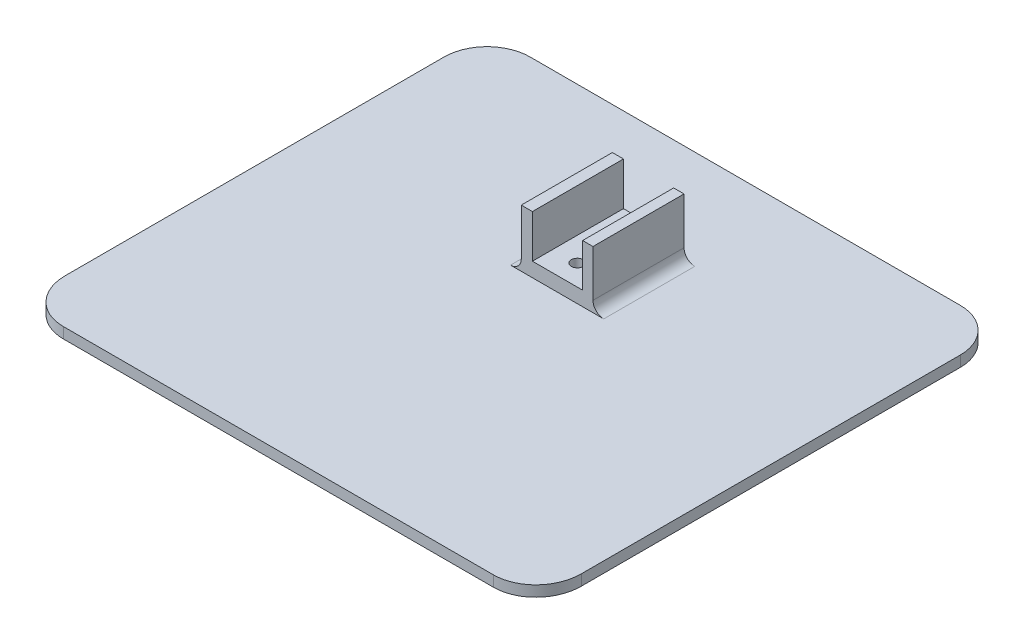
ISO-10303-21;
HEADER;
FILE_DESCRIPTION(('STEP AP214'),'2;1');
FILE_NAME('part.step','',(''),(''),'','','');
FILE_SCHEMA(('AUTOMOTIVE_DESIGN { 1 0 10303 214 1 1 1 1 }'));
ENDSEC;
DATA;
#1=APPLICATION_CONTEXT('core data for automotive mechanical design processes');
#2=APPLICATION_PROTOCOL_DEFINITION('international standard','automotive_design',2000,#1);
#3=PRODUCT_CONTEXT('',#1,'mechanical');
#4=PRODUCT('Part','Part','',(#3));
#5=PRODUCT_RELATED_PRODUCT_CATEGORY('part','',(#4));
#6=PRODUCT_DEFINITION_FORMATION('','',#4);
#7=PRODUCT_DEFINITION_CONTEXT('part definition',#1,'design');
#8=PRODUCT_DEFINITION('design','',#6,#7);
#9=PRODUCT_DEFINITION_SHAPE('','',#8);
#10=(LENGTH_UNIT() NAMED_UNIT(*) SI_UNIT(.MILLI.,.METRE.));
#11=(NAMED_UNIT(*) PLANE_ANGLE_UNIT() SI_UNIT($,.RADIAN.));
#12=(NAMED_UNIT(*) SI_UNIT($,.STERADIAN.) SOLID_ANGLE_UNIT());
#13=UNCERTAINTY_MEASURE_WITH_UNIT(LENGTH_MEASURE(1.E-05),#10,'distance_accuracy_value','');
#14=(GEOMETRIC_REPRESENTATION_CONTEXT(3) GLOBAL_UNCERTAINTY_ASSIGNED_CONTEXT((#13)) GLOBAL_UNIT_ASSIGNED_CONTEXT((#10,
#11,#12)) REPRESENTATION_CONTEXT('',''));
#15=CARTESIAN_POINT('',(0.,0.,0.));
#16=DIRECTION('',(0.,0.,1.));
#17=DIRECTION('',(1.,0.,0.));
#18=AXIS2_PLACEMENT_3D('',#15,#16,#17);
#19=CARTESIAN_POINT('',(-0.0197137799095512,3.,-9.76257394077398));
#20=DIRECTION('',(0.,-1.,0.));
#21=DIRECTION('',(0.,0.,-1.));
#22=AXIS2_PLACEMENT_3D('',#19,#20,#21);
#23=CYLINDRICAL_SURFACE('',#22,1.65586460411408);
#24=CARTESIAN_POINT('',(-0.0197137799095512,7.,-9.76257394077398));
#25=DIRECTION('',(0.,-1.,0.));
#26=DIRECTION('',(0.,0.,-1.));
#27=AXIS2_PLACEMENT_3D('',#24,#25,#26);
#28=CIRCLE('',#27,1.65586460411408);
#29=CARTESIAN_POINT('',(-0.0197137799095512,7.,-11.4184385448881));
#30=VERTEX_POINT('',#29);
#31=EDGE_CURVE('E336',#30,#30,#28,.T.);
#32=ORIENTED_EDGE('',*,*,#31,.F.);
#33=EDGE_LOOP('',(#32));
#34=FACE_BOUND('',#33,.T.);
#35=CARTESIAN_POINT('',(-0.0197137799095512,3.,-9.76257394077398));
#36=DIRECTION('',(0.,-1.,0.));
#37=DIRECTION('',(0.,0.,-1.));
#38=AXIS2_PLACEMENT_3D('',#35,#36,#37);
#39=CIRCLE('',#38,1.65586460411408);
#40=CARTESIAN_POINT('',(-0.0197137799095512,3.,-11.4184385448881));
#41=VERTEX_POINT('',#40);
#42=EDGE_CURVE('E45',#41,#41,#39,.T.);
#43=ORIENTED_EDGE('',*,*,#42,.T.);
#44=EDGE_LOOP('',(#43));
#45=FACE_BOUND('',#44,.T.);
#46=ADVANCED_FACE('F41',(#34,#45),#23,.F.);
#47=CARTESIAN_POINT('',(0.208651947899256,3.,-24.3779805205377));
#48=DIRECTION('',(0.,-1.,0.));
#49=DIRECTION('',(0.,0.,-1.));
#50=AXIS2_PLACEMENT_3D('',#47,#48,#49);
#51=CYLINDRICAL_SURFACE('',#50,1.65586460411408);
#52=CARTESIAN_POINT('',(0.208651947899256,7.,-24.3779805205377));
#53=DIRECTION('',(0.,-1.,0.));
#54=DIRECTION('',(0.,0.,-1.));
#55=AXIS2_PLACEMENT_3D('',#52,#53,#54);
#56=CIRCLE('',#55,1.65586460411408);
#57=CARTESIAN_POINT('',(0.208651947899256,7.,-26.0338451246518));
#58=VERTEX_POINT('',#57);
#59=EDGE_CURVE('E332',#58,#58,#56,.T.);
#60=ORIENTED_EDGE('',*,*,#59,.F.);
#61=EDGE_LOOP('',(#60));
#62=FACE_BOUND('',#61,.T.);
#63=CARTESIAN_POINT('',(0.208651947899256,3.,-24.3779805205377));
#64=DIRECTION('',(0.,-1.,0.));
#65=DIRECTION('',(0.,0.,-1.));
#66=AXIS2_PLACEMENT_3D('',#63,#64,#65);
#67=CIRCLE('',#66,1.65586460411408);
#68=CARTESIAN_POINT('',(0.208651947899256,3.,-26.0338451246518));
#69=VERTEX_POINT('',#68);
#70=EDGE_CURVE('E293',#69,#69,#67,.T.);
#71=ORIENTED_EDGE('',*,*,#70,.T.);
#72=EDGE_LOOP('',(#71));
#73=FACE_BOUND('',#72,.T.);
#74=ADVANCED_FACE('F258',(#62,#73),#51,.F.);
#75=CARTESIAN_POINT('',(0.,19.,0.));
#76=DIRECTION('',(0.,1.,0.));
#77=DIRECTION('',(0.,0.,1.));
#78=AXIS2_PLACEMENT_3D('',#75,#76,#77);
#79=PLANE('',#78);
#80=DIRECTION('',(-1.,0.,0.));
#81=VECTOR('',#80,1.);
#82=CARTESIAN_POINT('',(-9.83844917910209,19.,-29.348399165478));
#83=LINE('',#82,#81);
#84=CARTESIAN_POINT('',(10.1615508208979,19.,-29.348399165478));
#85=VERTEX_POINT('',#84);
#86=CARTESIAN_POINT('',(7.26901039257119,19.,-29.348399165478));
#87=VERTEX_POINT('',#86);
#88=EDGE_CURVE('E187',#85,#87,#83,.T.);
#89=ORIENTED_EDGE('',*,*,#88,.T.);
#90=DIRECTION('',(0.,0.,1.));
#91=VECTOR('',#90,1.);
#92=CARTESIAN_POINT('',(7.26901039257119,19.,-31.8785328430936));
#93=LINE('',#92,#91);
#94=CARTESIAN_POINT('',(7.26901039257119,19.,-3.94881677280326));
#95=VERTEX_POINT('',#94);
#96=EDGE_CURVE('E169',#87,#95,#93,.T.);
#97=ORIENTED_EDGE('',*,*,#96,.T.);
#98=DIRECTION('',(1.,0.,0.));
#99=VECTOR('',#98,1.);
#100=CARTESIAN_POINT('',(-9.83844917910209,19.,-3.94881677280326));
#101=LINE('',#100,#99);
#102=CARTESIAN_POINT('',(10.1615508208979,19.,-3.94881677280326));
#103=VERTEX_POINT('',#102);
#104=EDGE_CURVE('E347',#95,#103,#101,.T.);
#105=ORIENTED_EDGE('',*,*,#104,.T.);
#106=DIRECTION('',(0.,0.,-1.));
#107=VECTOR('',#106,1.);
#108=CARTESIAN_POINT('',(10.1615508208979,19.,-29.348399165478));
#109=LINE('',#108,#107);
#110=EDGE_CURVE('E195',#103,#85,#109,.T.);
#111=ORIENTED_EDGE('',*,*,#110,.T.);
#112=EDGE_LOOP('',(#89,#97,#105,#111));
#113=FACE_BOUND('',#112,.T.);
#114=ADVANCED_FACE('F193',(#113),#79,.T.);
#115=CARTESIAN_POINT('',(0.,3.,0.));
#116=DIRECTION('',(0.,1.,0.));
#117=DIRECTION('',(0.,0.,1.));
#118=AXIS2_PLACEMENT_3D('',#115,#116,#117);
#119=PLANE('',#118);
#120=DIRECTION('',(1.,0.,0.));
#121=VECTOR('',#120,1.);
#122=CARTESIAN_POINT('',(0.,3.,73.2589886833315));
#123=LINE('',#122,#121);
#124=CARTESIAN_POINT('',(-60.3911568152237,3.,73.2589886833315));
#125=VERTEX_POINT('',#124);
#126=CARTESIAN_POINT('',(59.6088431847762,3.,73.2589886833315));
#127=VERTEX_POINT('',#126);
#128=EDGE_CURVE('E227',#125,#127,#123,.T.);
#129=ORIENTED_EDGE('',*,*,#128,.T.);
#130=CARTESIAN_POINT('',(59.6088431847762,3.,73.2589886833315));
#131=CARTESIAN_POINT('',(60.1618256869811,3.,73.2589886833315));
#132=CARTESIAN_POINT('',(61.2791976498757,3.,73.1739631705418));
#133=CARTESIAN_POINT('',(62.8603074504887,3.,72.8306509965947));
#134=CARTESIAN_POINT('',(64.3486949624694,3.,72.2799535128836));
#135=CARTESIAN_POINT('',(66.0617717719845,3.,71.3753361875597));
#136=CARTESIAN_POINT('',(67.80435595317,3.,70.0062381590203));
#137=CARTESIAN_POINT('',(69.8226268527934,3.,67.6166682396859));
#138=CARTESIAN_POINT('',(71.258952654355,3.,64.4790605567734));
#139=CARTESIAN_POINT('',(71.6088431847769,3.,61.9992828553231));
#140=CARTESIAN_POINT('',(71.6088431847769,3.,60.7355746909624));
#141=B_SPLINE_CURVE_WITH_KNOTS('',3,(#130,#131,#132,#133,#134,#135,#136,#137,#138,#139,#140),
.UNSPECIFIED.,.F.,.F.,(4,1,1,1,1,1,1,1,4),(0.,0.0625,0.125,0.1875,0.25,0.375,0.5,0.75,1.),.UNSPECIFIED.);
#142=CARTESIAN_POINT('',(71.6088431847769,3.,60.7355746909624));
#143=VERTEX_POINT('',#142);
#144=EDGE_CURVE('E231',#127,#143,#141,.T.);
#145=ORIENTED_EDGE('',*,*,#144,.T.);
#146=DIRECTION('',(0.,0.,-1.));
#147=VECTOR('',#146,1.);
#148=CARTESIAN_POINT('',(71.6088431847769,3.,0.));
#149=LINE('',#148,#147);
#150=CARTESIAN_POINT('',(71.6088431847769,3.,-44.9655343216662));
#151=VERTEX_POINT('',#150);
#152=EDGE_CURVE('E238',#143,#151,#149,.T.);
#153=ORIENTED_EDGE('',*,*,#152,.T.);
#154=CARTESIAN_POINT('',(59.6088431847769,3.,-44.9655343216662));
#155=DIRECTION('',(0.,1.,0.));
#156=DIRECTION('',(0.,0.,1.));
#157=AXIS2_PLACEMENT_3D('',#154,#155,#156);
#158=CIRCLE('',#157,12.);
#159=CARTESIAN_POINT('',(59.6088431847769,3.,-56.9655343216662));
#160=VERTEX_POINT('',#159);
#161=EDGE_CURVE('E501',#151,#160,#158,.T.);
#162=ORIENTED_EDGE('',*,*,#161,.T.);
#163=DIRECTION('',(-1.,0.,0.));
#164=VECTOR('',#163,1.);
#165=CARTESIAN_POINT('',(0.,3.,-56.9655343216662));
#166=LINE('',#165,#164);
#167=CARTESIAN_POINT('',(-60.3911568152231,3.,-56.9655343216662));
#168=VERTEX_POINT('',#167);
#169=EDGE_CURVE('E486',#160,#168,#166,.T.);
#170=ORIENTED_EDGE('',*,*,#169,.T.);
#171=CARTESIAN_POINT('',(-60.3911568152231,3.,-44.9655343216662));
#172=DIRECTION('',(0.,1.,0.));
#173=DIRECTION('',(0.,0.,1.));
#174=AXIS2_PLACEMENT_3D('',#171,#172,#173);
#175=CIRCLE('',#174,12.);
#176=CARTESIAN_POINT('',(-72.3911568152231,3.,-44.9655343216662));
#177=VERTEX_POINT('',#176);
#178=EDGE_CURVE('E498',#168,#177,#175,.T.);
#179=ORIENTED_EDGE('',*,*,#178,.T.);
#180=DIRECTION('',(0.,0.,1.));
#181=VECTOR('',#180,1.);
#182=CARTESIAN_POINT('',(-72.3911568152231,3.,0.));
#183=LINE('',#182,#181);
#184=CARTESIAN_POINT('',(-72.3911568152231,3.,60.735574690963));
#185=VERTEX_POINT('',#184);
#186=EDGE_CURVE('E446',#177,#185,#183,.T.);
#187=ORIENTED_EDGE('',*,*,#186,.T.);
#188=CARTESIAN_POINT('',(-72.3911568152231,3.,60.735574690963));
#189=CARTESIAN_POINT('',(-72.3911568152231,3.,61.9921082250135));
#190=CARTESIAN_POINT('',(-72.1317676515068,3.,63.8412639961743));
#191=CARTESIAN_POINT('',(-71.1931340745274,3.,66.3312469236623));
#192=CARTESIAN_POINT('',(-70.1157544615747,3.,68.1934553387815));
#193=CARTESIAN_POINT('',(-68.6029168241761,3.,69.9901557441223));
#194=CARTESIAN_POINT('',(-66.8710431968823,3.,71.3562374650594));
#195=CARTESIAN_POINT('',(-65.1677731110002,3.,72.2641275582115));
#196=CARTESIAN_POINT('',(-63.6719548826544,3.,72.8224699197793));
#197=CARTESIAN_POINT('',(-62.0831439762588,3.,73.1709829742362));
#198=CARTESIAN_POINT('',(-60.9505699439983,3.,73.2589886833314));
#199=CARTESIAN_POINT('',(-60.3911568152237,3.,73.2589886833315));
#200=B_SPLINE_CURVE_WITH_KNOTS('',3,(#188,#189,#190,#191,#192,#193,#194,#195,#196,#197,#198,
#199),.UNSPECIFIED.,.F.,.F.,(4,1,1,1,1,1,1,1,1,4),(0.,0.25,0.375,0.5,0.625,0.75,0.8125,0.875,
0.9375,1.),.UNSPECIFIED.);
#201=EDGE_CURVE('E407',#185,#125,#200,.T.);
#202=ORIENTED_EDGE('',*,*,#201,.T.);
#203=EDGE_LOOP('',(#129,#145,#153,#162,#170,#179,#187,#202));
#204=FACE_BOUND('',#203,.T.);
#205=DIRECTION('',(-1.,0.,0.));
#206=VECTOR('',#205,1.);
#207=CARTESIAN_POINT('',(-9.83844917910209,3.,-29.348399165478));
#208=LINE('',#207,#206);
#209=CARTESIAN_POINT('',(13.1615508208979,3.,-29.348399165478));
#210=VERTEX_POINT('',#209);
#211=CARTESIAN_POINT('',(-12.8384491791021,3.,-29.348399165478));
#212=VERTEX_POINT('',#211);
#213=EDGE_CURVE('E211',#210,#212,#208,.T.);
#214=ORIENTED_EDGE('',*,*,#213,.F.);
#215=DIRECTION('',(0.,0.,-1.));
#216=VECTOR('',#215,1.);
#217=CARTESIAN_POINT('',(13.1615508208979,3.,0.));
#218=LINE('',#217,#216);
#219=CARTESIAN_POINT('',(13.1615508208979,3.,-3.94881677280326));
#220=VERTEX_POINT('',#219);
#221=EDGE_CURVE('E278',#210,#220,#218,.F.);
#222=ORIENTED_EDGE('',*,*,#221,.T.);
#223=DIRECTION('',(1.,0.,0.));
#224=VECTOR('',#223,1.);
#225=CARTESIAN_POINT('',(-9.83844917910209,3.,-3.94881677280326));
#226=LINE('',#225,#224);
#227=CARTESIAN_POINT('',(-12.8384491791021,3.,-3.94881677280326));
#228=VERTEX_POINT('',#227);
#229=EDGE_CURVE('E208',#228,#220,#226,.T.);
#230=ORIENTED_EDGE('',*,*,#229,.F.);
#231=DIRECTION('',(0.,0.,1.));
#232=VECTOR('',#231,1.);
#233=CARTESIAN_POINT('',(-12.8384491791021,3.,0.));
#234=LINE('',#233,#232);
#235=EDGE_CURVE('E360',#228,#212,#234,.F.);
#236=ORIENTED_EDGE('',*,*,#235,.T.);
#237=EDGE_LOOP('',(#214,#222,#230,#236));
#238=FACE_BOUND('',#237,.T.);
#239=ADVANCED_FACE('F254',(#204,#238),#119,.T.);
#240=CARTESIAN_POINT('',(0.,3.,73.2589886833315));
#241=DIRECTION('',(0.,0.,-1.));
#242=DIRECTION('',(-1.,0.,0.));
#243=AXIS2_PLACEMENT_3D('',#240,#241,#242);
#244=PLANE('',#243);
#245=DIRECTION('',(1.,0.,0.));
#246=VECTOR('',#245,1.);
#247=CARTESIAN_POINT('',(0.,0.,73.2589886833315));
#248=LINE('',#247,#246);
#249=CARTESIAN_POINT('',(-60.3911568152237,0.,73.2589886833315));
#250=VERTEX_POINT('',#249);
#251=CARTESIAN_POINT('',(59.6088431847762,0.,73.2589886833315));
#252=VERTEX_POINT('',#251);
#253=EDGE_CURVE('E226',#250,#252,#248,.T.);
#254=ORIENTED_EDGE('',*,*,#253,.T.);
#255=DIRECTION('',(0.,-1.,0.));
#256=VECTOR('',#255,1.);
#257=CARTESIAN_POINT('',(59.6088431847762,3.,73.2589886833315));
#258=LINE('',#257,#256);
#259=EDGE_CURVE('E375',#127,#252,#258,.T.);
#260=ORIENTED_EDGE('',*,*,#259,.F.);
#261=ORIENTED_EDGE('',*,*,#128,.F.);
#262=DIRECTION('',(0.,-1.,0.));
#263=VECTOR('',#262,1.);
#264=CARTESIAN_POINT('',(-60.3911568152237,3.,73.2589886833315));
#265=LINE('',#264,#263);
#266=EDGE_CURVE('E403',#125,#250,#265,.T.);
#267=ORIENTED_EDGE('',*,*,#266,.T.);
#268=EDGE_LOOP('',(#254,#260,#261,#267));
#269=FACE_BOUND('',#268,.T.);
#270=ADVANCED_FACE('F249',(#269),#244,.F.);
#271=DIRECTION('',(0.,-1.,0.));
#272=VECTOR('',#271,1.);
#273=SURFACE_OF_LINEAR_EXTRUSION('',#141,#272);
#274=CARTESIAN_POINT('',(59.6088431847762,0.,73.2589886833315));
#275=CARTESIAN_POINT('',(60.1618256869811,0.,73.2589886833315));
#276=CARTESIAN_POINT('',(61.2791976498757,0.,73.1739631705418));
#277=CARTESIAN_POINT('',(62.8603074504887,0.,72.8306509965947));
#278=CARTESIAN_POINT('',(64.3486949624694,0.,72.2799535128836));
#279=CARTESIAN_POINT('',(66.0617717719845,0.,71.3753361875597));
#280=CARTESIAN_POINT('',(67.80435595317,0.,70.0062381590203));
#281=CARTESIAN_POINT('',(69.8226268527934,0.,67.6166682396859));
#282=CARTESIAN_POINT('',(71.258952654355,0.,64.4790605567734));
#283=CARTESIAN_POINT('',(71.6088431847769,0.,61.9992828553231));
#284=CARTESIAN_POINT('',(71.6088431847769,0.,60.7355746909624));
#285=B_SPLINE_CURVE_WITH_KNOTS('',3,(#274,#275,#276,#277,#278,#279,#280,#281,#282,#283,#284),
.UNSPECIFIED.,.F.,.F.,(4,1,1,1,1,1,1,1,4),(0.,0.0625,0.125,0.1875,0.25,0.375,0.5,0.75,1.),.UNSPECIFIED.);
#286=CARTESIAN_POINT('',(71.6088431847769,0.,60.7355746909624));
#287=VERTEX_POINT('',#286);
#288=EDGE_CURVE('E430',#252,#287,#285,.T.);
#289=ORIENTED_EDGE('',*,*,#288,.T.);
#290=DIRECTION('',(0.,-1.,0.));
#291=VECTOR('',#290,1.);
#292=CARTESIAN_POINT('',(71.6088431847769,3.,60.7355746909624));
#293=LINE('',#292,#291);
#294=EDGE_CURVE('E379',#143,#287,#293,.T.);
#295=ORIENTED_EDGE('',*,*,#294,.F.);
#296=ORIENTED_EDGE('',*,*,#144,.F.);
#297=ORIENTED_EDGE('',*,*,#259,.T.);
#298=EDGE_LOOP('',(#289,#295,#296,#297));
#299=FACE_BOUND('',#298,.T.);
#300=ADVANCED_FACE('F244',(#299),#273,.F.);
#301=CARTESIAN_POINT('',(71.6088431847769,3.,0.));
#302=DIRECTION('',(-1.,0.,0.));
#303=DIRECTION('',(0.,0.,1.));
#304=AXIS2_PLACEMENT_3D('',#301,#302,#303);
#305=PLANE('',#304);
#306=DIRECTION('',(0.,0.,-1.));
#307=VECTOR('',#306,1.);
#308=CARTESIAN_POINT('',(71.6088431847769,0.,0.));
#309=LINE('',#308,#307);
#310=CARTESIAN_POINT('',(71.6088431847769,0.,-44.9655343216662));
#311=VERTEX_POINT('',#310);
#312=EDGE_CURVE('E427',#287,#311,#309,.T.);
#313=ORIENTED_EDGE('',*,*,#312,.T.);
#314=DIRECTION('',(0.,-1.,0.));
#315=VECTOR('',#314,1.);
#316=CARTESIAN_POINT('',(71.6088431847769,3.,-44.9655343216662));
#317=LINE('',#316,#315);
#318=EDGE_CURVE('E383',#151,#311,#317,.T.);
#319=ORIENTED_EDGE('',*,*,#318,.F.);
#320=ORIENTED_EDGE('',*,*,#152,.F.);
#321=ORIENTED_EDGE('',*,*,#294,.T.);
#322=EDGE_LOOP('',(#313,#319,#320,#321));
#323=FACE_BOUND('',#322,.T.);
#324=ADVANCED_FACE('F248',(#323),#305,.F.);
#325=CARTESIAN_POINT('',(59.6088431847769,3.,-44.9655343216662));
#326=DIRECTION('',(0.,-1.,0.));
#327=DIRECTION('',(0.,0.,-1.));
#328=AXIS2_PLACEMENT_3D('',#325,#326,#327);
#329=CYLINDRICAL_SURFACE('',#328,12.);
#330=CARTESIAN_POINT('',(59.6088431847769,0.,-44.9655343216662));
#331=DIRECTION('',(0.,1.,0.));
#332=DIRECTION('',(0.,0.,1.));
#333=AXIS2_PLACEMENT_3D('',#330,#331,#332);
#334=CIRCLE('',#333,12.);
#335=CARTESIAN_POINT('',(59.6088431847769,0.,-56.9655343216662));
#336=VERTEX_POINT('',#335);
#337=EDGE_CURVE('E424',#311,#336,#334,.T.);
#338=ORIENTED_EDGE('',*,*,#337,.T.);
#339=DIRECTION('',(0.,-1.,0.));
#340=VECTOR('',#339,1.);
#341=CARTESIAN_POINT('',(59.6088431847769,3.,-56.9655343216662));
#342=LINE('',#341,#340);
#343=EDGE_CURVE('E387',#160,#336,#342,.T.);
#344=ORIENTED_EDGE('',*,*,#343,.F.);
#345=ORIENTED_EDGE('',*,*,#161,.F.);
#346=ORIENTED_EDGE('',*,*,#318,.T.);
#347=EDGE_LOOP('',(#338,#344,#345,#346));
#348=FACE_BOUND('',#347,.T.);
#349=ADVANCED_FACE('F469',(#348),#329,.T.);
#350=CARTESIAN_POINT('',(0.,3.,-56.9655343216662));
#351=DIRECTION('',(0.,0.,1.));
#352=DIRECTION('',(1.,0.,0.));
#353=AXIS2_PLACEMENT_3D('',#350,#351,#352);
#354=PLANE('',#353);
#355=DIRECTION('',(-1.,0.,0.));
#356=VECTOR('',#355,1.);
#357=CARTESIAN_POINT('',(0.,0.,-56.9655343216662));
#358=LINE('',#357,#356);
#359=CARTESIAN_POINT('',(-60.3911568152231,0.,-56.9655343216662));
#360=VERTEX_POINT('',#359);
#361=EDGE_CURVE('E421',#336,#360,#358,.T.);
#362=ORIENTED_EDGE('',*,*,#361,.T.);
#363=DIRECTION('',(0.,-1.,0.));
#364=VECTOR('',#363,1.);
#365=CARTESIAN_POINT('',(-60.3911568152231,3.,-56.9655343216662));
#366=LINE('',#365,#364);
#367=EDGE_CURVE('E391',#168,#360,#366,.T.);
#368=ORIENTED_EDGE('',*,*,#367,.F.);
#369=ORIENTED_EDGE('',*,*,#169,.F.);
#370=ORIENTED_EDGE('',*,*,#343,.T.);
#371=EDGE_LOOP('',(#362,#368,#369,#370));
#372=FACE_BOUND('',#371,.T.);
#373=ADVANCED_FACE('F466',(#372),#354,.F.);
#374=CARTESIAN_POINT('',(-60.3911568152231,3.,-44.9655343216662));
#375=DIRECTION('',(0.,-1.,0.));
#376=DIRECTION('',(0.,0.,-1.));
#377=AXIS2_PLACEMENT_3D('',#374,#375,#376);
#378=CYLINDRICAL_SURFACE('',#377,12.);
#379=CARTESIAN_POINT('',(-60.3911568152231,0.,-44.9655343216662));
#380=DIRECTION('',(0.,1.,0.));
#381=DIRECTION('',(0.,0.,1.));
#382=AXIS2_PLACEMENT_3D('',#379,#380,#381);
#383=CIRCLE('',#382,12.);
#384=CARTESIAN_POINT('',(-72.3911568152231,0.,-44.9655343216662));
#385=VERTEX_POINT('',#384);
#386=EDGE_CURVE('E418',#360,#385,#383,.T.);
#387=ORIENTED_EDGE('',*,*,#386,.T.);
#388=DIRECTION('',(0.,-1.,0.));
#389=VECTOR('',#388,1.);
#390=CARTESIAN_POINT('',(-72.3911568152231,3.,-44.9655343216662));
#391=LINE('',#390,#389);
#392=EDGE_CURVE('E395',#177,#385,#391,.T.);
#393=ORIENTED_EDGE('',*,*,#392,.F.);
#394=ORIENTED_EDGE('',*,*,#178,.F.);
#395=ORIENTED_EDGE('',*,*,#367,.T.);
#396=EDGE_LOOP('',(#387,#393,#394,#395));
#397=FACE_BOUND('',#396,.T.);
#398=ADVANCED_FACE('F462',(#397),#378,.T.);
#399=CARTESIAN_POINT('',(-72.3911568152231,3.,0.));
#400=DIRECTION('',(1.,0.,0.));
#401=DIRECTION('',(0.,0.,-1.));
#402=AXIS2_PLACEMENT_3D('',#399,#400,#401);
#403=PLANE('',#402);
#404=DIRECTION('',(0.,0.,1.));
#405=VECTOR('',#404,1.);
#406=CARTESIAN_POINT('',(-72.3911568152231,0.,0.));
#407=LINE('',#406,#405);
#408=CARTESIAN_POINT('',(-72.3911568152231,0.,60.735574690963));
#409=VERTEX_POINT('',#408);
#410=EDGE_CURVE('E412',#385,#409,#407,.T.);
#411=ORIENTED_EDGE('',*,*,#410,.T.);
#412=DIRECTION('',(0.,-1.,0.));
#413=VECTOR('',#412,1.);
#414=CARTESIAN_POINT('',(-72.3911568152231,3.,60.735574690963));
#415=LINE('',#414,#413);
#416=EDGE_CURVE('E399',#185,#409,#415,.T.);
#417=ORIENTED_EDGE('',*,*,#416,.F.);
#418=ORIENTED_EDGE('',*,*,#186,.F.);
#419=ORIENTED_EDGE('',*,*,#392,.T.);
#420=EDGE_LOOP('',(#411,#417,#418,#419));
#421=FACE_BOUND('',#420,.T.);
#422=ADVANCED_FACE('F457',(#421),#403,.F.);
#423=DIRECTION('',(0.,-1.,0.));
#424=VECTOR('',#423,1.);
#425=SURFACE_OF_LINEAR_EXTRUSION('',#200,#424);
#426=CARTESIAN_POINT('',(-72.3911568152231,0.,60.735574690963));
#427=CARTESIAN_POINT('',(-72.3911568152231,0.,61.9921082250135));
#428=CARTESIAN_POINT('',(-72.1317676515068,0.,63.8412639961743));
#429=CARTESIAN_POINT('',(-71.1931340745274,0.,66.3312469236623));
#430=CARTESIAN_POINT('',(-70.1157544615747,0.,68.1934553387815));
#431=CARTESIAN_POINT('',(-68.6029168241761,0.,69.9901557441223));
#432=CARTESIAN_POINT('',(-66.8710431968823,0.,71.3562374650594));
#433=CARTESIAN_POINT('',(-65.1677731110002,0.,72.2641275582115));
#434=CARTESIAN_POINT('',(-63.6719548826544,0.,72.8224699197793));
#435=CARTESIAN_POINT('',(-62.0831439762588,0.,73.1709829742362));
#436=CARTESIAN_POINT('',(-60.9505699439983,0.,73.2589886833314));
#437=CARTESIAN_POINT('',(-60.3911568152237,0.,73.2589886833315));
#438=B_SPLINE_CURVE_WITH_KNOTS('',3,(#426,#427,#428,#429,#430,#431,#432,#433,#434,#435,#436,
#437),.UNSPECIFIED.,.F.,.F.,(4,1,1,1,1,1,1,1,1,4),(0.,0.25,0.375,0.5,0.625,0.75,0.8125,0.875,
0.9375,1.),.UNSPECIFIED.);
#439=EDGE_CURVE('E232',#409,#250,#438,.T.);
#440=ORIENTED_EDGE('',*,*,#439,.T.);
#441=ORIENTED_EDGE('',*,*,#266,.F.);
#442=ORIENTED_EDGE('',*,*,#201,.F.);
#443=ORIENTED_EDGE('',*,*,#416,.T.);
#444=EDGE_LOOP('',(#440,#441,#442,#443));
#445=FACE_BOUND('',#444,.T.);
#446=ADVANCED_FACE('F452',(#445),#425,.F.);
#447=CARTESIAN_POINT('',(0.,0.,0.));
#448=DIRECTION('',(0.,1.,0.));
#449=DIRECTION('',(0.,0.,1.));
#450=AXIS2_PLACEMENT_3D('',#447,#448,#449);
#451=PLANE('',#450);
#452=CARTESIAN_POINT('',(0.208651947899256,0.,-24.3779805205377));
#453=DIRECTION('',(0.,-1.,0.));
#454=DIRECTION('',(0.,0.,-1.));
#455=AXIS2_PLACEMENT_3D('',#452,#453,#454);
#456=CIRCLE('',#455,3.65586460411409);
#457=CARTESIAN_POINT('',(0.208651947899256,0.,-28.0338451246518));
#458=VERTEX_POINT('',#457);
#459=EDGE_CURVE('E303',#458,#458,#456,.T.);
#460=ORIENTED_EDGE('',*,*,#459,.F.);
#461=EDGE_LOOP('',(#460));
#462=FACE_BOUND('',#461,.T.);
#463=CARTESIAN_POINT('',(-0.0197137799095512,0.,-9.76257394077398));
#464=DIRECTION('',(0.,-1.,0.));
#465=DIRECTION('',(0.,0.,-1.));
#466=AXIS2_PLACEMENT_3D('',#463,#464,#465);
#467=CIRCLE('',#466,3.65586460411408);
#468=CARTESIAN_POINT('',(-0.0197137799095512,0.,-13.4184385448881));
#469=VERTEX_POINT('',#468);
#470=EDGE_CURVE('E315',#469,#469,#467,.T.);
#471=ORIENTED_EDGE('',*,*,#470,.F.);
#472=EDGE_LOOP('',(#471));
#473=FACE_BOUND('',#472,.T.);
#474=ORIENTED_EDGE('',*,*,#253,.F.);
#475=ORIENTED_EDGE('',*,*,#439,.F.);
#476=ORIENTED_EDGE('',*,*,#410,.F.);
#477=ORIENTED_EDGE('',*,*,#386,.F.);
#478=ORIENTED_EDGE('',*,*,#361,.F.);
#479=ORIENTED_EDGE('',*,*,#337,.F.);
#480=ORIENTED_EDGE('',*,*,#312,.F.);
#481=ORIENTED_EDGE('',*,*,#288,.F.);
#482=EDGE_LOOP('',(#474,#475,#476,#477,#478,#479,#480,#481));
#483=FACE_BOUND('',#482,.T.);
#484=ADVANCED_FACE('F456',(#462,#473,#483),#451,.F.);
#485=DIRECTION('',(0.,0.,1.));
#486=VECTOR('',#485,1.);
#487=CARTESIAN_POINT('',(-6.73098960742881,19.,-31.8785328430936));
#488=LINE('',#487,#486);
#489=CARTESIAN_POINT('',(-6.73098960742881,19.,-29.348399165478));
#490=VERTEX_POINT('',#489);
#491=CARTESIAN_POINT('',(-6.73098960742881,19.,-3.94881677280326));
#492=VERTEX_POINT('',#491);
#493=EDGE_CURVE('E181',#490,#492,#488,.T.);
#494=ORIENTED_EDGE('',*,*,#493,.F.);
#495=CARTESIAN_POINT('',(-9.83844917910209,19.,-29.348399165478));
#496=VERTEX_POINT('',#495);
#497=EDGE_CURVE('E199',#490,#496,#83,.T.);
#498=ORIENTED_EDGE('',*,*,#497,.T.);
#499=DIRECTION('',(0.,0.,1.));
#500=VECTOR('',#499,1.);
#501=CARTESIAN_POINT('',(-9.83844917910209,19.,-29.348399165478));
#502=LINE('',#501,#500);
#503=CARTESIAN_POINT('',(-9.83844917910209,19.,-3.94881677280326));
#504=VERTEX_POINT('',#503);
#505=EDGE_CURVE('E214',#496,#504,#502,.T.);
#506=ORIENTED_EDGE('',*,*,#505,.T.);
#507=EDGE_CURVE('E348',#504,#492,#101,.T.);
#508=ORIENTED_EDGE('',*,*,#507,.T.);
#509=EDGE_LOOP('',(#494,#498,#506,#508));
#510=FACE_BOUND('',#509,.T.);
#511=ADVANCED_FACE('F515',(#510),#79,.T.);
#512=CARTESIAN_POINT('',(-9.83844917910209,19.,-29.348399165478));
#513=DIRECTION('',(1.,0.,0.));
#514=DIRECTION('',(0.,0.,-1.));
#515=AXIS2_PLACEMENT_3D('',#512,#513,#514);
#516=PLANE('',#515);
#517=DIRECTION('',(0.,-1.,0.));
#518=VECTOR('',#517,1.);
#519=CARTESIAN_POINT('',(-9.83844917910209,19.,-29.348399165478));
#520=LINE('',#519,#518);
#521=CARTESIAN_POINT('',(-9.83844917910209,6.,-29.348399165478));
#522=VERTEX_POINT('',#521);
#523=EDGE_CURVE('E198',#496,#522,#520,.T.);
#524=ORIENTED_EDGE('',*,*,#523,.T.);
#525=DIRECTION('',(0.,0.,1.));
#526=VECTOR('',#525,1.);
#527=CARTESIAN_POINT('',(-9.83844917910209,6.,-29.348399165478));
#528=LINE('',#527,#526);
#529=CARTESIAN_POINT('',(-9.83844917910209,6.,-3.94881677280326));
#530=VERTEX_POINT('',#529);
#531=EDGE_CURVE('E290',#522,#530,#528,.T.);
#532=ORIENTED_EDGE('',*,*,#531,.T.);
#533=DIRECTION('',(0.,-1.,0.));
#534=VECTOR('',#533,1.);
#535=CARTESIAN_POINT('',(-9.83844917910209,19.,-3.94881677280326));
#536=LINE('',#535,#534);
#537=EDGE_CURVE('E222',#504,#530,#536,.T.);
#538=ORIENTED_EDGE('',*,*,#537,.F.);
#539=ORIENTED_EDGE('',*,*,#505,.F.);
#540=EDGE_LOOP('',(#524,#532,#538,#539));
#541=FACE_BOUND('',#540,.T.);
#542=ADVANCED_FACE('F517',(#541),#516,.F.);
#543=CARTESIAN_POINT('',(-9.83844917910209,19.,-3.94881677280326));
#544=DIRECTION('',(0.,0.,-1.));
#545=DIRECTION('',(-1.,0.,0.));
#546=AXIS2_PLACEMENT_3D('',#543,#544,#545);
#547=PLANE('',#546);
#548=DIRECTION('',(-1.,0.,0.));
#549=VECTOR('',#548,1.);
#550=CARTESIAN_POINT('',(-9.83844917910209,7.,-3.94881677280326));
#551=LINE('',#550,#549);
#552=CARTESIAN_POINT('',(7.26901039257119,7.,-3.94881677280326));
#553=VERTEX_POINT('',#552);
#554=CARTESIAN_POINT('',(-6.73098960742881,7.,-3.94881677280326));
#555=VERTEX_POINT('',#554);
#556=EDGE_CURVE('E325',#553,#555,#551,.T.);
#557=ORIENTED_EDGE('',*,*,#556,.T.);
#558=DIRECTION('',(0.,1.,0.));
#559=VECTOR('',#558,1.);
#560=CARTESIAN_POINT('',(-6.73098960742881,19.,-3.94881677280326));
#561=LINE('',#560,#559);
#562=EDGE_CURVE('E212',#555,#492,#561,.T.);
#563=ORIENTED_EDGE('',*,*,#562,.T.);
#564=ORIENTED_EDGE('',*,*,#507,.F.);
#565=ORIENTED_EDGE('',*,*,#537,.T.);
#566=CARTESIAN_POINT('',(-12.8384491791021,6.,-3.94881677280326));
#567=DIRECTION('',(0.,0.,-1.));
#568=DIRECTION('',(-1.,0.,0.));
#569=AXIS2_PLACEMENT_3D('',#566,#567,#568);
#570=CIRCLE('',#569,3.);
#571=EDGE_CURVE('E51',#530,#228,#570,.T.);
#572=ORIENTED_EDGE('',*,*,#571,.T.);
#573=ORIENTED_EDGE('',*,*,#229,.T.);
#574=CARTESIAN_POINT('',(13.1615508208979,6.,-3.94881677280326));
#575=DIRECTION('',(0.,0.,-1.));
#576=DIRECTION('',(-1.,0.,0.));
#577=AXIS2_PLACEMENT_3D('',#574,#575,#576);
#578=CIRCLE('',#577,3.);
#579=CARTESIAN_POINT('',(10.1615508208979,6.,-3.94881677280326));
#580=VERTEX_POINT('',#579);
#581=EDGE_CURVE('E276',#220,#580,#578,.T.);
#582=ORIENTED_EDGE('',*,*,#581,.T.);
#583=DIRECTION('',(0.,-1.,0.));
#584=VECTOR('',#583,1.);
#585=CARTESIAN_POINT('',(10.1615508208979,19.,-3.94881677280326));
#586=LINE('',#585,#584);
#587=EDGE_CURVE('E218',#103,#580,#586,.T.);
#588=ORIENTED_EDGE('',*,*,#587,.F.);
#589=ORIENTED_EDGE('',*,*,#104,.F.);
#590=DIRECTION('',(0.,1.,0.));
#591=VECTOR('',#590,1.);
#592=CARTESIAN_POINT('',(7.26901039257119,19.,-3.94881677280326));
#593=LINE('',#592,#591);
#594=EDGE_CURVE('E176',#553,#95,#593,.T.);
#595=ORIENTED_EDGE('',*,*,#594,.F.);
#596=EDGE_LOOP('',(#557,#563,#564,#565,#572,#573,#582,#588,#589,#595));
#597=FACE_BOUND('',#596,.T.);
#598=ADVANCED_FACE('F355',(#597),#547,.F.);
#599=CARTESIAN_POINT('',(10.1615508208979,19.,-29.348399165478));
#600=DIRECTION('',(-1.,0.,0.));
#601=DIRECTION('',(0.,0.,1.));
#602=AXIS2_PLACEMENT_3D('',#599,#600,#601);
#603=PLANE('',#602);
#604=ORIENTED_EDGE('',*,*,#587,.T.);
#605=DIRECTION('',(0.,0.,-1.));
#606=VECTOR('',#605,1.);
#607=CARTESIAN_POINT('',(10.1615508208979,6.,-29.348399165478));
#608=LINE('',#607,#606);
#609=CARTESIAN_POINT('',(10.1615508208979,6.,-29.348399165478));
#610=VERTEX_POINT('',#609);
#611=EDGE_CURVE('E280',#580,#610,#608,.T.);
#612=ORIENTED_EDGE('',*,*,#611,.T.);
#613=DIRECTION('',(0.,-1.,0.));
#614=VECTOR('',#613,1.);
#615=CARTESIAN_POINT('',(10.1615508208979,19.,-29.348399165478));
#616=LINE('',#615,#614);
#617=EDGE_CURVE('E203',#85,#610,#616,.T.);
#618=ORIENTED_EDGE('',*,*,#617,.F.);
#619=ORIENTED_EDGE('',*,*,#110,.F.);
#620=EDGE_LOOP('',(#604,#612,#618,#619));
#621=FACE_BOUND('',#620,.T.);
#622=ADVANCED_FACE('F357',(#621),#603,.F.);
#623=CARTESIAN_POINT('',(-9.83844917910209,19.,-29.348399165478));
#624=DIRECTION('',(0.,0.,1.));
#625=DIRECTION('',(1.,0.,0.));
#626=AXIS2_PLACEMENT_3D('',#623,#624,#625);
#627=PLANE('',#626);
#628=ORIENTED_EDGE('',*,*,#497,.F.);
#629=DIRECTION('',(0.,-1.,0.));
#630=VECTOR('',#629,1.);
#631=CARTESIAN_POINT('',(-6.73098960742881,19.,-29.348399165478));
#632=LINE('',#631,#630);
#633=CARTESIAN_POINT('',(-6.73098960742881,7.,-29.348399165478));
#634=VERTEX_POINT('',#633);
#635=EDGE_CURVE('E191',#490,#634,#632,.T.);
#636=ORIENTED_EDGE('',*,*,#635,.T.);
#637=DIRECTION('',(1.,0.,0.));
#638=VECTOR('',#637,1.);
#639=CARTESIAN_POINT('',(-9.83844917910209,7.,-29.348399165478));
#640=LINE('',#639,#638);
#641=CARTESIAN_POINT('',(7.26901039257119,7.,-29.348399165478));
#642=VERTEX_POINT('',#641);
#643=EDGE_CURVE('E189',#634,#642,#640,.T.);
#644=ORIENTED_EDGE('',*,*,#643,.T.);
#645=DIRECTION('',(0.,-1.,0.));
#646=VECTOR('',#645,1.);
#647=CARTESIAN_POINT('',(7.26901039257119,19.,-29.348399165478));
#648=LINE('',#647,#646);
#649=EDGE_CURVE('E173',#87,#642,#648,.T.);
#650=ORIENTED_EDGE('',*,*,#649,.F.);
#651=ORIENTED_EDGE('',*,*,#88,.F.);
#652=ORIENTED_EDGE('',*,*,#617,.T.);
#653=CARTESIAN_POINT('',(13.1615508208979,6.,-29.348399165478));
#654=DIRECTION('',(0.,0.,1.));
#655=DIRECTION('',(1.,0.,0.));
#656=AXIS2_PLACEMENT_3D('',#653,#654,#655);
#657=CIRCLE('',#656,3.);
#658=EDGE_CURVE('E284',#610,#210,#657,.T.);
#659=ORIENTED_EDGE('',*,*,#658,.T.);
#660=ORIENTED_EDGE('',*,*,#213,.T.);
#661=CARTESIAN_POINT('',(-12.8384491791021,6.,-29.348399165478));
#662=DIRECTION('',(0.,0.,1.));
#663=DIRECTION('',(1.,0.,0.));
#664=AXIS2_PLACEMENT_3D('',#661,#662,#663);
#665=CIRCLE('',#664,3.);
#666=EDGE_CURVE('E11',#212,#522,#665,.T.);
#667=ORIENTED_EDGE('',*,*,#666,.T.);
#668=ORIENTED_EDGE('',*,*,#523,.F.);
#669=EDGE_LOOP('',(#628,#636,#644,#650,#651,#652,#659,#660,#667,#668));
#670=FACE_BOUND('',#669,.T.);
#671=ADVANCED_FACE('F185',(#670),#627,.F.);
#672=CARTESIAN_POINT('',(-6.73098960742881,7.,-31.8785328430936));
#673=DIRECTION('',(-1.,0.,0.));
#674=DIRECTION('',(0.,0.,1.));
#675=AXIS2_PLACEMENT_3D('',#672,#673,#674);
#676=PLANE('',#675);
#677=DIRECTION('',(0.,0.,1.));
#678=VECTOR('',#677,1.);
#679=CARTESIAN_POINT('',(-6.73098960742881,7.,-31.8785328430936));
#680=LINE('',#679,#678);
#681=EDGE_CURVE('E322',#634,#555,#680,.T.);
#682=ORIENTED_EDGE('',*,*,#681,.F.);
#683=ORIENTED_EDGE('',*,*,#635,.F.);
#684=ORIENTED_EDGE('',*,*,#493,.T.);
#685=ORIENTED_EDGE('',*,*,#562,.F.);
#686=EDGE_LOOP('',(#682,#683,#684,#685));
#687=FACE_BOUND('',#686,.T.);
#688=ADVANCED_FACE('F525',(#687),#676,.F.);
#689=CARTESIAN_POINT('',(7.26901039257119,7.,-31.8785328430936));
#690=DIRECTION('',(-1.,0.,0.));
#691=DIRECTION('',(0.,0.,1.));
#692=AXIS2_PLACEMENT_3D('',#689,#690,#691);
#693=PLANE('',#692);
#694=ORIENTED_EDGE('',*,*,#594,.T.);
#695=ORIENTED_EDGE('',*,*,#96,.F.);
#696=ORIENTED_EDGE('',*,*,#649,.T.);
#697=DIRECTION('',(0.,0.,1.));
#698=VECTOR('',#697,1.);
#699=CARTESIAN_POINT('',(7.26901039257119,7.,-31.8785328430936));
#700=LINE('',#699,#698);
#701=EDGE_CURVE('E319',#642,#553,#700,.T.);
#702=ORIENTED_EDGE('',*,*,#701,.T.);
#703=EDGE_LOOP('',(#694,#695,#696,#702));
#704=FACE_BOUND('',#703,.T.);
#705=ADVANCED_FACE('F171',(#704),#693,.T.);
#706=CARTESIAN_POINT('',(0.,7.,0.));
#707=DIRECTION('',(0.,-1.,0.));
#708=DIRECTION('',(0.,0.,-1.));
#709=AXIS2_PLACEMENT_3D('',#706,#707,#708);
#710=PLANE('',#709);
#711=ORIENTED_EDGE('',*,*,#31,.T.);
#712=EDGE_LOOP('',(#711));
#713=FACE_BOUND('',#712,.T.);
#714=ORIENTED_EDGE('',*,*,#59,.T.);
#715=EDGE_LOOP('',(#714));
#716=FACE_BOUND('',#715,.T.);
#717=ORIENTED_EDGE('',*,*,#701,.F.);
#718=ORIENTED_EDGE('',*,*,#643,.F.);
#719=ORIENTED_EDGE('',*,*,#681,.T.);
#720=ORIENTED_EDGE('',*,*,#556,.F.);
#721=EDGE_LOOP('',(#717,#718,#719,#720));
#722=FACE_BOUND('',#721,.T.);
#723=ADVANCED_FACE('F264',(#713,#716,#722),#710,.F.);
#724=CARTESIAN_POINT('',(13.1615508208979,6.,-29.348399165478));
#725=DIRECTION('',(0.,0.,-1.));
#726=DIRECTION('',(-1.,0.,0.));
#727=AXIS2_PLACEMENT_3D('',#724,#725,#726);
#728=CYLINDRICAL_SURFACE('',#727,3.);
#729=ORIENTED_EDGE('',*,*,#581,.F.);
#730=ORIENTED_EDGE('',*,*,#221,.F.);
#731=ORIENTED_EDGE('',*,*,#658,.F.);
#732=ORIENTED_EDGE('',*,*,#611,.F.);
#733=EDGE_LOOP('',(#729,#730,#731,#732));
#734=FACE_BOUND('',#733,.T.);
#735=ADVANCED_FACE('F262',(#734),#728,.F.);
#736=CARTESIAN_POINT('',(-12.8384491791021,6.,-29.348399165478));
#737=DIRECTION('',(0.,0.,1.));
#738=DIRECTION('',(1.,0.,0.));
#739=AXIS2_PLACEMENT_3D('',#736,#737,#738);
#740=CYLINDRICAL_SURFACE('',#739,3.);
#741=ORIENTED_EDGE('',*,*,#666,.F.);
#742=ORIENTED_EDGE('',*,*,#235,.F.);
#743=ORIENTED_EDGE('',*,*,#571,.F.);
#744=ORIENTED_EDGE('',*,*,#531,.F.);
#745=EDGE_LOOP('',(#741,#742,#743,#744));
#746=FACE_BOUND('',#745,.T.);
#747=ADVANCED_FACE('F43',(#746),#740,.F.);
#748=CARTESIAN_POINT('',(-0.0197137799095512,3.,-9.76257394077398));
#749=DIRECTION('',(0.,-1.,0.));
#750=DIRECTION('',(0.,0.,-1.));
#751=AXIS2_PLACEMENT_3D('',#748,#749,#750);
#752=CYLINDRICAL_SURFACE('',#751,3.65586460411408);
#753=CARTESIAN_POINT('',(-0.0197137799095512,3.,-9.76257394077398));
#754=DIRECTION('',(0.,-1.,0.));
#755=DIRECTION('',(0.,0.,-1.));
#756=AXIS2_PLACEMENT_3D('',#753,#754,#755);
#757=CIRCLE('',#756,3.65586460411408);
#758=CARTESIAN_POINT('',(-0.0197137799095512,3.,-13.4184385448881));
#759=VERTEX_POINT('',#758);
#760=EDGE_CURVE('E309',#759,#759,#757,.T.);
#761=ORIENTED_EDGE('',*,*,#760,.F.);
#762=EDGE_LOOP('',(#761));
#763=FACE_BOUND('',#762,.T.);
#764=ORIENTED_EDGE('',*,*,#470,.T.);
#765=EDGE_LOOP('',(#764));
#766=FACE_BOUND('',#765,.T.);
#767=ADVANCED_FACE('F270',(#763,#766),#752,.F.);
#768=CARTESIAN_POINT('',(-0.0197137799095512,3.,-9.76257394077398));
#769=DIRECTION('',(0.,-1.,0.));
#770=DIRECTION('',(0.,0.,-1.));
#771=AXIS2_PLACEMENT_3D('',#768,#769,#770);
#772=PLANE('',#771);
#773=ORIENTED_EDGE('',*,*,#42,.F.);
#774=EDGE_LOOP('',(#773));
#775=FACE_BOUND('',#774,.T.);
#776=ORIENTED_EDGE('',*,*,#760,.T.);
#777=EDGE_LOOP('',(#776));
#778=FACE_BOUND('',#777,.T.);
#779=ADVANCED_FACE('F535',(#775,#778),#772,.T.);
#780=CARTESIAN_POINT('',(0.208651947899256,3.,-24.3779805205377));
#781=DIRECTION('',(0.,-1.,0.));
#782=DIRECTION('',(0.,0.,-1.));
#783=AXIS2_PLACEMENT_3D('',#780,#781,#782);
#784=CYLINDRICAL_SURFACE('',#783,3.65586460411409);
#785=CARTESIAN_POINT('',(0.208651947899256,3.,-24.3779805205377));
#786=DIRECTION('',(0.,-1.,0.));
#787=DIRECTION('',(0.,0.,-1.));
#788=AXIS2_PLACEMENT_3D('',#785,#786,#787);
#789=CIRCLE('',#788,3.65586460411409);
#790=CARTESIAN_POINT('',(0.208651947899256,3.,-28.0338451246518));
#791=VERTEX_POINT('',#790);
#792=EDGE_CURVE('E296',#791,#791,#789,.T.);
#793=ORIENTED_EDGE('',*,*,#792,.F.);
#794=EDGE_LOOP('',(#793));
#795=FACE_BOUND('',#794,.T.);
#796=ORIENTED_EDGE('',*,*,#459,.T.);
#797=EDGE_LOOP('',(#796));
#798=FACE_BOUND('',#797,.T.);
#799=ADVANCED_FACE('F539',(#795,#798),#784,.F.);
#800=CARTESIAN_POINT('',(0.208651947899256,3.,-24.3779805205377));
#801=DIRECTION('',(0.,-1.,0.));
#802=DIRECTION('',(0.,0.,-1.));
#803=AXIS2_PLACEMENT_3D('',#800,#801,#802);
#804=PLANE('',#803);
#805=ORIENTED_EDGE('',*,*,#70,.F.);
#806=EDGE_LOOP('',(#805));
#807=FACE_BOUND('',#806,.T.);
#808=ORIENTED_EDGE('',*,*,#792,.T.);
#809=EDGE_LOOP('',(#808));
#810=FACE_BOUND('',#809,.T.);
#811=ADVANCED_FACE('F543',(#807,#810),#804,.T.);
#812=CLOSED_SHELL('',(#46,#74,#114,#239,#270,#300,#324,#349,#373,#398,#422,#446,#484,#511,#542,
#598,#622,#671,#688,#705,#723,#735,#747,#767,#779,#799,#811));
#813=MANIFOLD_SOLID_BREP('B2',#812);
#814=ADVANCED_BREP_SHAPE_REPRESENTATION('',(#18,#813),#14);
#815=SHAPE_DEFINITION_REPRESENTATION(#9,#814);
ENDSEC;
END-ISO-10303-21;
